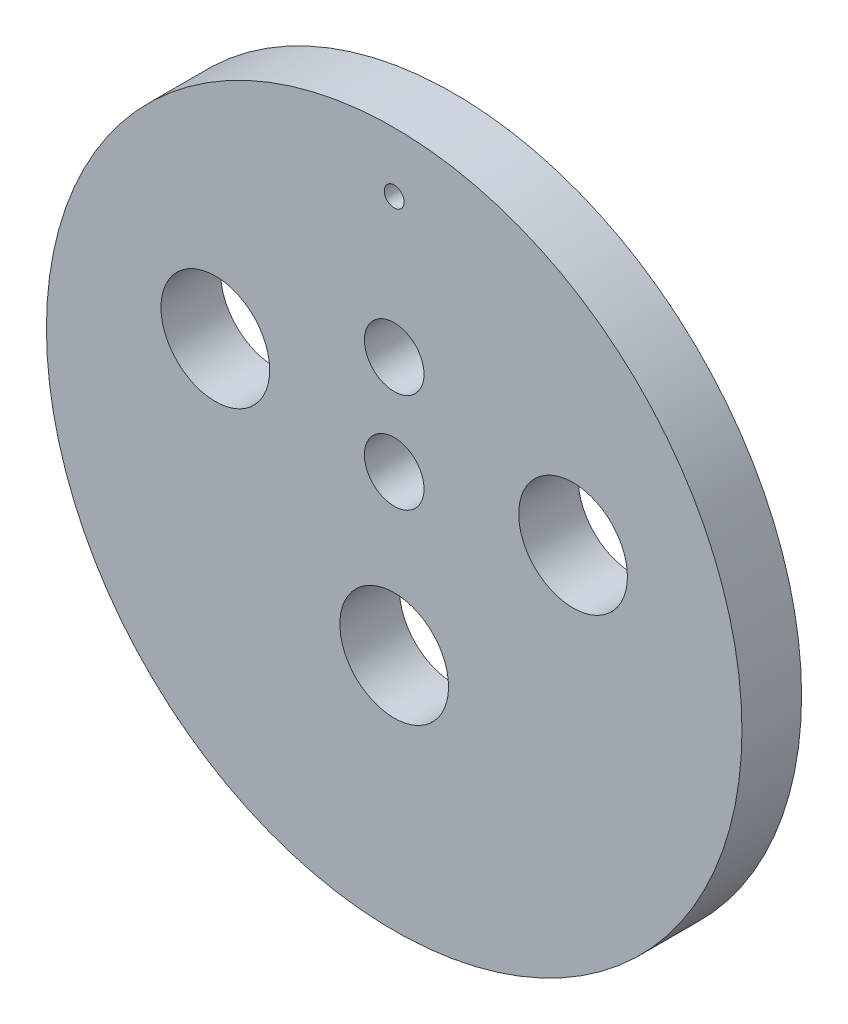
ISO-10303-21;
HEADER;
FILE_DESCRIPTION(('STEP AP214'),'2;1');
FILE_NAME('part.step','',(''),(''),'','','');
FILE_SCHEMA(('AUTOMOTIVE_DESIGN { 1 0 10303 214 1 1 1 1 }'));
ENDSEC;
DATA;
#1=APPLICATION_CONTEXT('core data for automotive mechanical design processes');
#2=APPLICATION_PROTOCOL_DEFINITION('international standard','automotive_design',2000,#1);
#3=PRODUCT_CONTEXT('',#1,'mechanical');
#4=PRODUCT('Part','Part','',(#3));
#5=PRODUCT_RELATED_PRODUCT_CATEGORY('part','',(#4));
#6=PRODUCT_DEFINITION_FORMATION('','',#4);
#7=PRODUCT_DEFINITION_CONTEXT('part definition',#1,'design');
#8=PRODUCT_DEFINITION('design','',#6,#7);
#9=PRODUCT_DEFINITION_SHAPE('','',#8);
#10=(LENGTH_UNIT() NAMED_UNIT(*) SI_UNIT(.MILLI.,.METRE.));
#11=(NAMED_UNIT(*) PLANE_ANGLE_UNIT() SI_UNIT($,.RADIAN.));
#12=(NAMED_UNIT(*) SI_UNIT($,.STERADIAN.) SOLID_ANGLE_UNIT());
#13=UNCERTAINTY_MEASURE_WITH_UNIT(LENGTH_MEASURE(1.E-05),#10,'distance_accuracy_value','');
#14=(GEOMETRIC_REPRESENTATION_CONTEXT(3) GLOBAL_UNCERTAINTY_ASSIGNED_CONTEXT((#13)) GLOBAL_UNIT_ASSIGNED_CONTEXT((#10,
#11,#12)) REPRESENTATION_CONTEXT('',''));
#15=CARTESIAN_POINT('',(0.,0.,0.));
#16=DIRECTION('',(0.,0.,1.));
#17=DIRECTION('',(1.,0.,0.));
#18=AXIS2_PLACEMENT_3D('',#15,#16,#17);
#19=CARTESIAN_POINT('',(0.,0.,3.));
#20=DIRECTION('',(0.,0.,-1.));
#21=DIRECTION('',(-1.,0.,0.));
#22=AXIS2_PLACEMENT_3D('',#19,#20,#21);
#23=CYLINDRICAL_SURFACE('',#22,17.5);
#24=CARTESIAN_POINT('',(0.,0.,3.));
#25=DIRECTION('',(0.,0.,1.));
#26=DIRECTION('',(1.,0.,0.));
#27=AXIS2_PLACEMENT_3D('',#24,#25,#26);
#28=CIRCLE('',#27,17.5);
#29=CARTESIAN_POINT('',(17.5,0.,3.));
#30=VERTEX_POINT('',#29);
#31=EDGE_CURVE('E10',#30,#30,#28,.T.);
#32=ORIENTED_EDGE('',*,*,#31,.F.);
#33=EDGE_LOOP('',(#32));
#34=FACE_BOUND('',#33,.T.);
#35=CARTESIAN_POINT('',(0.,0.,0.));
#36=DIRECTION('',(0.,0.,1.));
#37=DIRECTION('',(1.,0.,0.));
#38=AXIS2_PLACEMENT_3D('',#35,#36,#37);
#39=CIRCLE('',#38,17.5);
#40=CARTESIAN_POINT('',(17.5,0.,0.));
#41=VERTEX_POINT('',#40);
#42=EDGE_CURVE('E41',#41,#41,#39,.T.);
#43=ORIENTED_EDGE('',*,*,#42,.T.);
#44=EDGE_LOOP('',(#43));
#45=FACE_BOUND('',#44,.T.);
#46=ADVANCED_FACE('F38',(#34,#45),#23,.T.);
#47=CARTESIAN_POINT('',(0.,0.,3.));
#48=DIRECTION('',(0.,0.,1.));
#49=DIRECTION('',(1.,0.,0.));
#50=AXIS2_PLACEMENT_3D('',#47,#48,#49);
#51=PLANE('',#50);
#52=CARTESIAN_POINT('',(0.,7.50000000000001,3.));
#53=DIRECTION('',(0.,0.,1.));
#54=DIRECTION('',(1.,0.,0.));
#55=AXIS2_PLACEMENT_3D('',#52,#53,#54);
#56=CIRCLE('',#55,1.5);
#57=CARTESIAN_POINT('',(1.5,7.50000000000001,3.));
#58=VERTEX_POINT('',#57);
#59=EDGE_CURVE('E80',#58,#58,#56,.T.);
#60=ORIENTED_EDGE('',*,*,#59,.F.);
#61=EDGE_LOOP('',(#60));
#62=FACE_BOUND('',#61,.T.);
#63=CARTESIAN_POINT('',(0.,2.5,3.));
#64=DIRECTION('',(0.,0.,1.));
#65=DIRECTION('',(1.,0.,0.));
#66=AXIS2_PLACEMENT_3D('',#63,#64,#65);
#67=CIRCLE('',#66,1.5);
#68=CARTESIAN_POINT('',(1.5,2.5,3.));
#69=VERTEX_POINT('',#68);
#70=EDGE_CURVE('E77',#69,#69,#67,.T.);
#71=ORIENTED_EDGE('',*,*,#70,.F.);
#72=EDGE_LOOP('',(#71));
#73=FACE_BOUND('',#72,.T.);
#74=CARTESIAN_POINT('',(0.,-5.50000000000001,3.));
#75=DIRECTION('',(0.,0.,1.));
#76=DIRECTION('',(1.,0.,0.));
#77=AXIS2_PLACEMENT_3D('',#74,#75,#76);
#78=CIRCLE('',#77,2.735);
#79=CARTESIAN_POINT('',(2.735,-5.50000000000001,3.));
#80=VERTEX_POINT('',#79);
#81=EDGE_CURVE('E69',#80,#80,#78,.T.);
#82=ORIENTED_EDGE('',*,*,#81,.F.);
#83=EDGE_LOOP('',(#82));
#84=FACE_BOUND('',#83,.T.);
#85=CARTESIAN_POINT('',(0.,14.5,3.));
#86=DIRECTION('',(0.,0.,1.));
#87=DIRECTION('',(1.,0.,0.));
#88=AXIS2_PLACEMENT_3D('',#85,#86,#87);
#89=CIRCLE('',#88,0.5);
#90=CARTESIAN_POINT('',(0.5,14.5,3.));
#91=VERTEX_POINT('',#90);
#92=EDGE_CURVE('E66',#91,#91,#89,.T.);
#93=ORIENTED_EDGE('',*,*,#92,.F.);
#94=EDGE_LOOP('',(#93));
#95=FACE_BOUND('',#94,.T.);
#96=CARTESIAN_POINT('',(-9.,3.8,3.));
#97=DIRECTION('',(0.,0.,1.));
#98=DIRECTION('',(1.,0.,0.));
#99=AXIS2_PLACEMENT_3D('',#96,#97,#98);
#100=CIRCLE('',#99,2.735);
#101=CARTESIAN_POINT('',(-6.265,3.8,3.));
#102=VERTEX_POINT('',#101);
#103=EDGE_CURVE('E60',#102,#102,#100,.T.);
#104=ORIENTED_EDGE('',*,*,#103,.F.);
#105=EDGE_LOOP('',(#104));
#106=FACE_BOUND('',#105,.T.);
#107=CARTESIAN_POINT('',(9.,3.8,3.));
#108=DIRECTION('',(0.,0.,1.));
#109=DIRECTION('',(1.,0.,0.));
#110=AXIS2_PLACEMENT_3D('',#107,#108,#109);
#111=CIRCLE('',#110,2.735);
#112=CARTESIAN_POINT('',(11.735,3.8,3.));
#113=VERTEX_POINT('',#112);
#114=EDGE_CURVE('E53',#113,#113,#111,.T.);
#115=ORIENTED_EDGE('',*,*,#114,.F.);
#116=EDGE_LOOP('',(#115));
#117=FACE_BOUND('',#116,.T.);
#118=ORIENTED_EDGE('',*,*,#31,.T.);
#119=EDGE_LOOP('',(#118));
#120=FACE_BOUND('',#119,.T.);
#121=ADVANCED_FACE('F96',(#62,#73,#84,#95,#106,#117,#120),#51,.T.);
#122=CARTESIAN_POINT('',(0.,0.,0.));
#123=DIRECTION('',(0.,0.,1.));
#124=DIRECTION('',(1.,0.,0.));
#125=AXIS2_PLACEMENT_3D('',#122,#123,#124);
#126=PLANE('',#125);
#127=CARTESIAN_POINT('',(0.,7.50000000000001,0.));
#128=DIRECTION('',(0.,0.,1.));
#129=DIRECTION('',(1.,0.,0.));
#130=AXIS2_PLACEMENT_3D('',#127,#128,#129);
#131=CIRCLE('',#130,1.5);
#132=CARTESIAN_POINT('',(1.5,7.50000000000001,0.));
#133=VERTEX_POINT('',#132);
#134=EDGE_CURVE('E54',#133,#133,#131,.T.);
#135=ORIENTED_EDGE('',*,*,#134,.T.);
#136=EDGE_LOOP('',(#135));
#137=FACE_BOUND('',#136,.T.);
#138=CARTESIAN_POINT('',(0.,2.5,0.));
#139=DIRECTION('',(0.,0.,1.));
#140=DIRECTION('',(1.,0.,0.));
#141=AXIS2_PLACEMENT_3D('',#138,#139,#140);
#142=CIRCLE('',#141,1.5);
#143=CARTESIAN_POINT('',(1.5,2.5,0.));
#144=VERTEX_POINT('',#143);
#145=EDGE_CURVE('E74',#144,#144,#142,.T.);
#146=ORIENTED_EDGE('',*,*,#145,.T.);
#147=EDGE_LOOP('',(#146));
#148=FACE_BOUND('',#147,.T.);
#149=CARTESIAN_POINT('',(0.,-5.50000000000001,0.));
#150=DIRECTION('',(0.,0.,1.));
#151=DIRECTION('',(1.,0.,0.));
#152=AXIS2_PLACEMENT_3D('',#149,#150,#151);
#153=CIRCLE('',#152,2.735);
#154=CARTESIAN_POINT('',(2.735,-5.50000000000001,0.));
#155=VERTEX_POINT('',#154);
#156=EDGE_CURVE('E48',#155,#155,#153,.T.);
#157=ORIENTED_EDGE('',*,*,#156,.T.);
#158=EDGE_LOOP('',(#157));
#159=FACE_BOUND('',#158,.T.);
#160=CARTESIAN_POINT('',(0.,14.5,0.));
#161=DIRECTION('',(0.,0.,1.));
#162=DIRECTION('',(1.,0.,0.));
#163=AXIS2_PLACEMENT_3D('',#160,#161,#162);
#164=CIRCLE('',#163,0.5);
#165=CARTESIAN_POINT('',(0.5,14.5,0.));
#166=VERTEX_POINT('',#165);
#167=EDGE_CURVE('E63',#166,#166,#164,.T.);
#168=ORIENTED_EDGE('',*,*,#167,.T.);
#169=EDGE_LOOP('',(#168));
#170=FACE_BOUND('',#169,.T.);
#171=CARTESIAN_POINT('',(-9.,3.8,0.));
#172=DIRECTION('',(0.,0.,1.));
#173=DIRECTION('',(1.,0.,0.));
#174=AXIS2_PLACEMENT_3D('',#171,#172,#173);
#175=CIRCLE('',#174,2.735);
#176=CARTESIAN_POINT('',(-6.265,3.8,0.));
#177=VERTEX_POINT('',#176);
#178=EDGE_CURVE('E57',#177,#177,#175,.T.);
#179=ORIENTED_EDGE('',*,*,#178,.T.);
#180=EDGE_LOOP('',(#179));
#181=FACE_BOUND('',#180,.T.);
#182=CARTESIAN_POINT('',(9.,3.8,0.));
#183=DIRECTION('',(0.,0.,1.));
#184=DIRECTION('',(1.,0.,0.));
#185=AXIS2_PLACEMENT_3D('',#182,#183,#184);
#186=CIRCLE('',#185,2.735);
#187=CARTESIAN_POINT('',(11.735,3.8,0.));
#188=VERTEX_POINT('',#187);
#189=EDGE_CURVE('E50',#188,#188,#186,.T.);
#190=ORIENTED_EDGE('',*,*,#189,.T.);
#191=EDGE_LOOP('',(#190));
#192=FACE_BOUND('',#191,.T.);
#193=ORIENTED_EDGE('',*,*,#42,.F.);
#194=EDGE_LOOP('',(#193));
#195=FACE_BOUND('',#194,.T.);
#196=ADVANCED_FACE('F86',(#137,#148,#159,#170,#181,#192,#195),#126,.F.);
#197=CARTESIAN_POINT('',(9.,3.8,0.));
#198=DIRECTION('',(0.,0.,1.));
#199=DIRECTION('',(1.,0.,0.));
#200=AXIS2_PLACEMENT_3D('',#197,#198,#199);
#201=CYLINDRICAL_SURFACE('',#200,2.735);
#202=ORIENTED_EDGE('',*,*,#189,.F.);
#203=EDGE_LOOP('',(#202));
#204=FACE_BOUND('',#203,.T.);
#205=ORIENTED_EDGE('',*,*,#114,.T.);
#206=EDGE_LOOP('',(#205));
#207=FACE_BOUND('',#206,.T.);
#208=ADVANCED_FACE('F110',(#204,#207),#201,.F.);
#209=CARTESIAN_POINT('',(-9.,3.8,0.));
#210=DIRECTION('',(0.,0.,1.));
#211=DIRECTION('',(1.,0.,0.));
#212=AXIS2_PLACEMENT_3D('',#209,#210,#211);
#213=CYLINDRICAL_SURFACE('',#212,2.735);
#214=ORIENTED_EDGE('',*,*,#178,.F.);
#215=EDGE_LOOP('',(#214));
#216=FACE_BOUND('',#215,.T.);
#217=ORIENTED_EDGE('',*,*,#103,.T.);
#218=EDGE_LOOP('',(#217));
#219=FACE_BOUND('',#218,.T.);
#220=ADVANCED_FACE('F112',(#216,#219),#213,.F.);
#221=CARTESIAN_POINT('',(0.,14.5,0.));
#222=DIRECTION('',(0.,0.,1.));
#223=DIRECTION('',(1.,0.,0.));
#224=AXIS2_PLACEMENT_3D('',#221,#222,#223);
#225=CYLINDRICAL_SURFACE('',#224,0.5);
#226=ORIENTED_EDGE('',*,*,#167,.F.);
#227=EDGE_LOOP('',(#226));
#228=FACE_BOUND('',#227,.T.);
#229=ORIENTED_EDGE('',*,*,#92,.T.);
#230=EDGE_LOOP('',(#229));
#231=FACE_BOUND('',#230,.T.);
#232=ADVANCED_FACE('F119',(#228,#231),#225,.F.);
#233=CARTESIAN_POINT('',(0.,-5.50000000000001,0.));
#234=DIRECTION('',(0.,0.,1.));
#235=DIRECTION('',(1.,0.,0.));
#236=AXIS2_PLACEMENT_3D('',#233,#234,#235);
#237=CYLINDRICAL_SURFACE('',#236,2.735);
#238=ORIENTED_EDGE('',*,*,#156,.F.);
#239=EDGE_LOOP('',(#238));
#240=FACE_BOUND('',#239,.T.);
#241=ORIENTED_EDGE('',*,*,#81,.T.);
#242=EDGE_LOOP('',(#241));
#243=FACE_BOUND('',#242,.T.);
#244=ADVANCED_FACE('F150',(#240,#243),#237,.F.);
#245=CARTESIAN_POINT('',(0.,2.5,0.));
#246=DIRECTION('',(0.,0.,1.));
#247=DIRECTION('',(1.,0.,0.));
#248=AXIS2_PLACEMENT_3D('',#245,#246,#247);
#249=CYLINDRICAL_SURFACE('',#248,1.5);
#250=ORIENTED_EDGE('',*,*,#145,.F.);
#251=EDGE_LOOP('',(#250));
#252=FACE_BOUND('',#251,.T.);
#253=ORIENTED_EDGE('',*,*,#70,.T.);
#254=EDGE_LOOP('',(#253));
#255=FACE_BOUND('',#254,.T.);
#256=ADVANCED_FACE('F92',(#252,#255),#249,.F.);
#257=CARTESIAN_POINT('',(0.,7.50000000000001,0.));
#258=DIRECTION('',(0.,0.,1.));
#259=DIRECTION('',(1.,0.,0.));
#260=AXIS2_PLACEMENT_3D('',#257,#258,#259);
#261=CYLINDRICAL_SURFACE('',#260,1.5);
#262=ORIENTED_EDGE('',*,*,#134,.F.);
#263=EDGE_LOOP('',(#262));
#264=FACE_BOUND('',#263,.T.);
#265=ORIENTED_EDGE('',*,*,#59,.T.);
#266=EDGE_LOOP('',(#265));
#267=FACE_BOUND('',#266,.T.);
#268=ADVANCED_FACE('F89',(#264,#267),#261,.F.);
#269=CLOSED_SHELL('',(#46,#121,#196,#208,#220,#232,#244,#256,#268));
#270=MANIFOLD_SOLID_BREP('B2',#269);
#271=ADVANCED_BREP_SHAPE_REPRESENTATION('',(#18,#270),#14);
#272=SHAPE_DEFINITION_REPRESENTATION(#9,#271);
ENDSEC;
END-ISO-10303-21;
